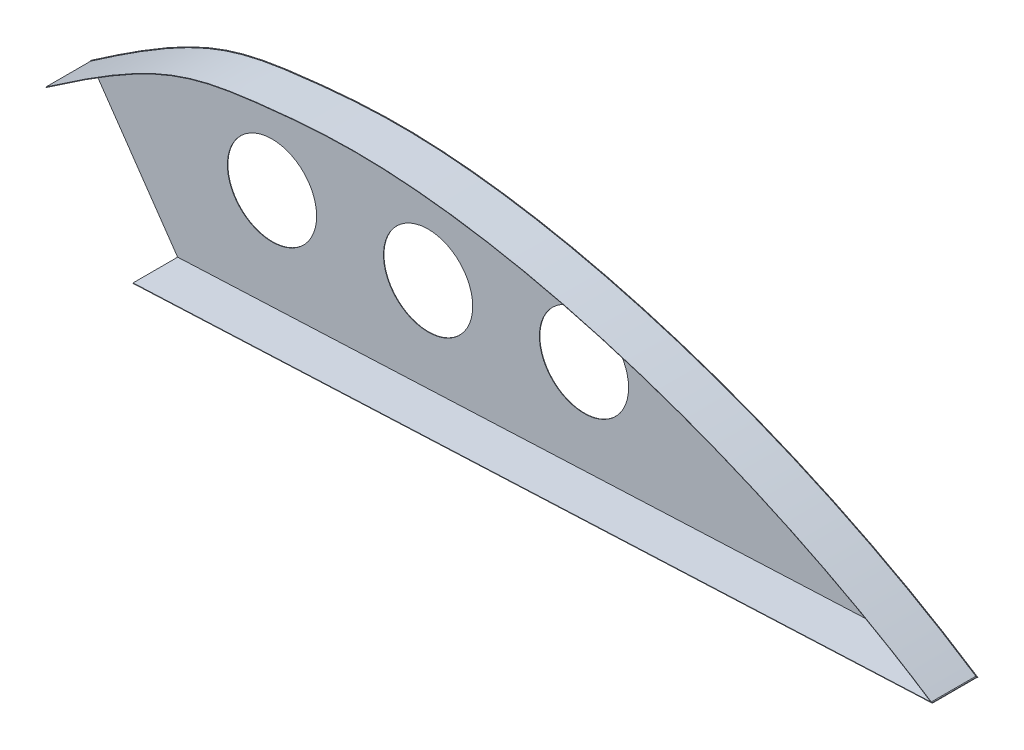
ISO-10303-21;
HEADER;
FILE_DESCRIPTION(('STEP AP214'),'2;1');
FILE_NAME('part.step','',(''),(''),'','','');
FILE_SCHEMA(('AUTOMOTIVE_DESIGN { 1 0 10303 214 1 1 1 1 }'));
ENDSEC;
DATA;
#1=APPLICATION_CONTEXT('core data for automotive mechanical design processes');
#2=APPLICATION_PROTOCOL_DEFINITION('international standard','automotive_design',2000,#1);
#3=PRODUCT_CONTEXT('',#1,'mechanical');
#4=PRODUCT('Part','Part','',(#3));
#5=PRODUCT_RELATED_PRODUCT_CATEGORY('part','',(#4));
#6=PRODUCT_DEFINITION_FORMATION('','',#4);
#7=PRODUCT_DEFINITION_CONTEXT('part definition',#1,'design');
#8=PRODUCT_DEFINITION('design','',#6,#7);
#9=PRODUCT_DEFINITION_SHAPE('','',#8);
#10=(LENGTH_UNIT() NAMED_UNIT(*) SI_UNIT(.MILLI.,.METRE.));
#11=(NAMED_UNIT(*) PLANE_ANGLE_UNIT() SI_UNIT($,.RADIAN.));
#12=(NAMED_UNIT(*) SI_UNIT($,.STERADIAN.) SOLID_ANGLE_UNIT());
#13=UNCERTAINTY_MEASURE_WITH_UNIT(LENGTH_MEASURE(1.E-05),#10,'distance_accuracy_value','');
#14=(GEOMETRIC_REPRESENTATION_CONTEXT(3) GLOBAL_UNCERTAINTY_ASSIGNED_CONTEXT((#13)) GLOBAL_UNIT_ASSIGNED_CONTEXT((#10,
#11,#12)) REPRESENTATION_CONTEXT('',''));
#15=CARTESIAN_POINT('',(0.,0.,0.));
#16=DIRECTION('',(0.,0.,1.));
#17=DIRECTION('',(1.,0.,0.));
#18=AXIS2_PLACEMENT_3D('',#15,#16,#17);
#19=CARTESIAN_POINT('',(-1659.53553734202,615.24308702669,0.099999999999989));
#20=DIRECTION('',(0.,0.,1.));
#21=DIRECTION('',(1.,0.,0.));
#22=AXIS2_PLACEMENT_3D('',#19,#20,#21);
#23=PLANE('',#22);
#24=CARTESIAN_POINT('',(-1702.86573801061,588.986400452499,0.099999999999989));
#25=DIRECTION('',(0.,0.,1.));
#26=DIRECTION('',(1.,0.,0.));
#27=AXIS2_PLACEMENT_3D('',#24,#25,#26);
#28=CIRCLE('',#27,10.0000000000001);
#29=CARTESIAN_POINT('',(-1692.86573801061,588.986400452499,0.099999999999989));
#30=VERTEX_POINT('',#29);
#31=EDGE_CURVE('E310',#30,#30,#28,.T.);
#32=ORIENTED_EDGE('',*,*,#31,.F.);
#33=EDGE_LOOP('',(#32));
#34=FACE_BOUND('',#33,.T.);
#35=CARTESIAN_POINT('',(-1667.86573801061,588.986400452499,0.099999999999989));
#36=DIRECTION('',(0.,0.,1.));
#37=DIRECTION('',(1.,0.,0.));
#38=AXIS2_PLACEMENT_3D('',#35,#36,#37);
#39=CIRCLE('',#38,9.99999999999985);
#40=CARTESIAN_POINT('',(-1657.86573801061,588.986400452499,0.099999999999989));
#41=VERTEX_POINT('',#40);
#42=EDGE_CURVE('E251',#41,#41,#39,.T.);
#43=ORIENTED_EDGE('',*,*,#42,.F.);
#44=EDGE_LOOP('',(#43));
#45=FACE_BOUND('',#44,.T.);
#46=CARTESIAN_POINT('',(-1632.90629090363,590.67075729533,0.099999999999989));
#47=DIRECTION('',(0.,0.,1.));
#48=DIRECTION('',(1.,0.,0.));
#49=AXIS2_PLACEMENT_3D('',#46,#47,#48);
#50=CIRCLE('',#49,10.0000000000001);
#51=CARTESIAN_POINT('',(-1622.90629090363,590.67075729533,0.099999999999989));
#52=VERTEX_POINT('',#51);
#53=EDGE_CURVE('E304',#52,#52,#50,.T.);
#54=ORIENTED_EDGE('',*,*,#53,.F.);
#55=EDGE_LOOP('',(#54));
#56=FACE_BOUND('',#55,.T.);
#57=DIRECTION('',(0.567607096396232,-0.823299571310856,0.));
#58=VECTOR('',#57,1.);
#59=CARTESIAN_POINT('',(-1743.60796018332,593.83047017767,0.099999999999989));
#60=LINE('',#59,#58);
#61=CARTESIAN_POINT('',(-1743.60796018332,593.83047017767,0.099999999999989));
#62=VERTEX_POINT('',#61);
#63=CARTESIAN_POINT('',(-1743.55109327918,593.748213839778,0.099999999999989));
#64=VERTEX_POINT('',#63);
#65=EDGE_CURVE('E228',#62,#64,#60,.T.);
#66=ORIENTED_EDGE('',*,*,#65,.T.);
#67=CARTESIAN_POINT('',(-1545.02307971094,573.566578824358,0.0999999999999977));
#68=CARTESIAN_POINT('',(-1580.38557088212,596.721777485731,0.0999999999999977));
#69=CARTESIAN_POINT('',(-1623.54009886865,611.778467090319,0.0999999999999977));
#70=CARTESIAN_POINT('',(-1664.05894449368,615.565415197453,0.0999999999999977));
#71=CARTESIAN_POINT('',(-1668.46062374473,615.803565887457,0.0999999999999977));
#72=CARTESIAN_POINT('',(-1674.85027289541,615.874635066804,0.0999999999999977));
#73=CARTESIAN_POINT('',(-1676.94608228937,615.848904452693,0.0999999999999977));
#74=CARTESIAN_POINT('',(-1681.05156214421,615.710135669524,0.0999999999999977));
#75=CARTESIAN_POINT('',(-1685.06731264814,615.488156685975,0.0999999999999977));
#76=CARTESIAN_POINT('',(-1688.83699666007,615.157146300184,0.0999999999999977));
#77=CARTESIAN_POINT('',(-1692.45037214897,614.800321889409,0.0999999999999977));
#78=CARTESIAN_POINT('',(-1694.17704598943,614.610346383111,0.0999999999999977));
#79=CARTESIAN_POINT('',(-1699.08573934283,614.035305054447,0.0999999999999977));
#80=CARTESIAN_POINT('',(-1702.01910126724,613.629485697198,0.0999999999999977));
#81=CARTESIAN_POINT('',(-1710.37850281503,612.027658052934,0.0999999999999977));
#82=CARTESIAN_POINT('',(-1715.3642242429,610.448022257473,0.0999999999999977));
#83=CARTESIAN_POINT('',(-1727.25276065684,604.565604120329,0.0999999999999977));
#84=CARTESIAN_POINT('',(-1734.15508646799,600.261986908841,0.0999999999999977));
#85=CARTESIAN_POINT('',(-1743.55098689514,593.748287184085,0.0999999999999977));
#86=B_SPLINE_CURVE_WITH_KNOTS('',3,(#67,#68,#69,#70,#71,#72,#73,#74,#75,#76,#77,#78,#79,#80,#81,
#82,#83,#84,#85),.UNSPECIFIED.,.F.,.F.,(4,2,2,2,1,2,2,2,2,4),(0.00149626207820732,
0.500000000000015,0.562500000000018,0.593750000000017,0.625000000000017,0.656250000000016,
0.687500000000016,0.750000000000011,0.875000000000006,1.),.UNSPECIFIED.);
#87=CARTESIAN_POINT('',(-1545.02307971094,573.566578824358,0.099999999999989));
#88=VERTEX_POINT('',#87);
#89=EDGE_CURVE('E145',#88,#64,#86,.T.);
#90=ORIENTED_EDGE('',*,*,#89,.F.);
#91=DIRECTION('',(0.995602692003064,0.093676462765476,0.));
#92=VECTOR('',#91,1.);
#93=CARTESIAN_POINT('',(-1545.02307971094,573.566578824358,0.099999999999989));
#94=LINE('',#93,#92);
#95=CARTESIAN_POINT('',(-1545.18274259771,573.55155611039,0.099999999999989));
#96=VERTEX_POINT('',#95);
#97=EDGE_CURVE('E140',#96,#88,#94,.T.);
#98=ORIENTED_EDGE('',*,*,#97,.F.);
#99=CARTESIAN_POINT('',(-1743.49401360697,593.6661041905,0.099999999999989));
#100=CARTESIAN_POINT('',(-1742.91824458099,594.065255562428,0.099999999999989));
#101=CARTESIAN_POINT('',(-1741.7499700871,594.871411778841,0.099999999999989));
#102=CARTESIAN_POINT('',(-1739.52608503395,596.390203290394,0.099999999999989));
#103=CARTESIAN_POINT('',(-1736.86780536305,598.174714984537,0.099999999999989));
#104=CARTESIAN_POINT('',(-1733.88088062316,600.125360581459,0.099999999999989));
#105=CARTESIAN_POINT('',(-1730.13578168037,602.491531609274,0.099999999999989));
#106=CARTESIAN_POINT('',(-1725.85926230919,605.03094097859,0.099999999999989));
#107=CARTESIAN_POINT('',(-1721.23073897953,607.488971472824,0.099999999999989));
#108=CARTESIAN_POINT('',(-1716.96258970869,609.437107419652,0.099999999999989));
#109=CARTESIAN_POINT('',(-1711.5599855395,611.460964287125,0.099999999999989));
#110=CARTESIAN_POINT('',(-1704.98089947415,613.117091179344,0.099999999999989));
#111=CARTESIAN_POINT('',(-1697.68082062825,614.126469300056,0.099999999999989));
#112=CARTESIAN_POINT('',(-1690.80335479766,614.881158472116,0.099999999999989));
#113=CARTESIAN_POINT('',(-1683.28277337283,615.549802626295,0.099999999999989));
#114=CARTESIAN_POINT('',(-1672.98979224291,615.951202382141,0.099999999999989));
#115=CARTESIAN_POINT('',(-1659.83071516768,615.239913168315,0.099999999999989));
#116=CARTESIAN_POINT('',(-1645.98401951829,613.44325149694,0.099999999999989));
#117=CARTESIAN_POINT('',(-1626.86027597124,609.633108879116,0.099999999999989));
#118=CARTESIAN_POINT('',(-1607.08890876538,603.79419794505,0.099999999999989));
#119=CARTESIAN_POINT('',(-1587.37621875437,596.094131565247,0.099999999999989));
#120=CARTESIAN_POINT('',(-1572.79576399975,589.430500324126,0.099999999999989));
#121=CARTESIAN_POINT('',(-1560.96559801217,583.174479228239,0.099999999999989));
#122=CARTESIAN_POINT('',(-1551.77383994301,577.764017719471,0.099999999999989));
#123=CARTESIAN_POINT('',(-1547.29656460549,574.935715783306,0.099999999999989));
#124=CARTESIAN_POINT('',(-1545.07786026992,573.482918258034,0.099999999999989));
#125=B_SPLINE_CURVE_WITH_KNOTS('',3,(#99,#100,#101,#102,#103,#104,#105,#106,#107,#108,#109,#110,
#111,#112,#113,#114,#115,#116,#117,#118,#119,#120,#121,#122,#123,#124),.UNSPECIFIED.,.F.,.F.,(4,
1,1,1,1,1,1,1,1,1,1,1,1,1,1,1,1,1,1,1,1,1,1,4),(0.00149626207820783,0.00929707253072185,
0.0170978829832359,0.0326995038882639,0.0483011247932919,0.0639027456983199,0.0951059875083758,
0.126309229318432,0.157512471128488,0.188715712938544,0.251122196558656,0.313528680178768,
0.344731921988824,0.37593516379888,0.438341647418992,0.500748131039104,0.563154614659216,
0.625561098279328,0.750374065519552,0.812780549139664,0.875187032759776,0.937593516379888,
0.968796758189944,1.),.UNSPECIFIED.);
#126=CARTESIAN_POINT('',(-1743.49401360697,593.6661041905,0.099999999999989));
#127=VERTEX_POINT('',#126);
#128=EDGE_CURVE('E187',#127,#96,#125,.T.);
#129=ORIENTED_EDGE('',*,*,#128,.F.);
#130=DIRECTION('',(0.569732881743784,-0.821829935850431,0.));
#131=VECTOR('',#130,1.);
#132=CARTESIAN_POINT('',(-1743.55098689514,593.748287184085,0.099999999999989));
#133=LINE('',#132,#131);
#134=EDGE_CURVE('E229',#64,#127,#133,.T.);
#135=ORIENTED_EDGE('',*,*,#134,.F.);
#136=CARTESIAN_POINT('',(-1723.97557604015,565.354199265099,0.099999999999989));
#137=VERTEX_POINT('',#136);
#138=EDGE_CURVE('E234',#64,#137,#60,.T.);
#139=ORIENTED_EDGE('',*,*,#138,.T.);
#140=DIRECTION('',(-0.47111626041238,0.882071124782494,0.));
#141=VECTOR('',#140,1.);
#142=CARTESIAN_POINT('',(-1106.4007933582,-590.931263522244,0.099999999999989));
#143=LINE('',#142,#141);
#144=CARTESIAN_POINT('',(-1724.02778305262,565.451946471216,0.099999999999989));
#145=VERTEX_POINT('',#144);
#146=EDGE_CURVE('E296',#137,#145,#143,.T.);
#147=ORIENTED_EDGE('',*,*,#146,.T.);
#148=DIRECTION('',(-0.998984631984301,-0.045052248103632,0.));
#149=VECTOR('',#148,1.);
#150=CARTESIAN_POINT('',(-28.9482829167909,641.896708232776,0.099999999999989));
#151=LINE('',#150,#149);
#152=CARTESIAN_POINT('',(-1544.80283170476,573.53464035455,0.099999999999989));
#153=VERTEX_POINT('',#152);
#154=EDGE_CURVE('E62',#153,#145,#151,.T.);
#155=ORIENTED_EDGE('',*,*,#154,.F.);
#156=DIRECTION('',(0.0450522481076401,-0.99898463198412,0.));
#157=VECTOR('',#156,1.);
#158=CARTESIAN_POINT('',(-1515.85454878512,-68.3620678841911,0.099999999999989));
#159=LINE('',#158,#157);
#160=CARTESIAN_POINT('',(-1544.79832647999,573.434741892322,0.099999999999989));
#161=VERTEX_POINT('',#160);
#162=EDGE_CURVE('E148',#153,#161,#159,.T.);
#163=ORIENTED_EDGE('',*,*,#162,.T.);
#164=DIRECTION('',(0.998984631984055,0.0450522481090856,0.));
#165=VECTOR('',#164,1.);
#166=CARTESIAN_POINT('',(-1723.97557604015,565.354199265099,0.099999999999989));
#167=LINE('',#166,#165);
#168=CARTESIAN_POINT('',(-1544.64995665935,573.441433080312,0.099999999999989));
#169=VERTEX_POINT('',#168);
#170=EDGE_CURVE('E233',#161,#169,#167,.T.);
#171=ORIENTED_EDGE('',*,*,#170,.T.);
#172=CARTESIAN_POINT('',(-1544.64995665935,573.441433080312,0.099999999999989));
#173=CARTESIAN_POINT('',(-1585.71664888804,600.423930322912,0.099999999999989));
#174=CARTESIAN_POINT('',(-1646.28028973819,619.241808081414,0.099999999999989));
#175=CARTESIAN_POINT('',(-1709.38954114273,613.399774738818,0.099999999999989));
#176=CARTESIAN_POINT('',(-1719.50790421298,610.537812827554,0.099999999999989));
#177=CARTESIAN_POINT('',(-1743.60796018332,593.83047017767,0.099999999999989));
#178=B_SPLINE_CURVE_WITH_KNOTS('',3,(#172,#173,#174,#175,#176,#177),.UNSPECIFIED.,.F.,.F.,(4,1,
1,4),(0.,0.579445357910707,0.679445357910707,1.),.UNSPECIFIED.);
#179=EDGE_CURVE('E237',#169,#62,#178,.T.);
#180=ORIENTED_EDGE('',*,*,#179,.T.);
#181=EDGE_LOOP('',(#66,#90,#98,#129,#135,#139,#147,#155,#163,#171,#180));
#182=FACE_BOUND('',#181,.T.);
#183=ADVANCED_FACE('F34',(#34,#45,#56,#182),#23,.T.);
#184=CARTESIAN_POINT('',(-1659.53553734202,615.24308702669,0.));
#185=DIRECTION('',(0.,0.,1.));
#186=DIRECTION('',(1.,0.,0.));
#187=AXIS2_PLACEMENT_3D('',#184,#185,#186);
#188=PLANE('',#187);
#189=CARTESIAN_POINT('',(-1544.64995665935,573.441433080312,0.));
#190=CARTESIAN_POINT('',(-1585.71664888804,600.423930322912,0.));
#191=CARTESIAN_POINT('',(-1646.28028973819,619.241808081414,0.));
#192=CARTESIAN_POINT('',(-1709.38954114273,613.399774738818,0.));
#193=CARTESIAN_POINT('',(-1719.50790421298,610.537812827554,0.));
#194=CARTESIAN_POINT('',(-1743.60796018332,593.83047017767,0.));
#195=B_SPLINE_CURVE_WITH_KNOTS('',3,(#189,#190,#191,#192,#193,#194),.UNSPECIFIED.,.F.,.F.,(4,1,
1,4),(0.,0.579445357910707,0.679445357910707,1.),.UNSPECIFIED.);
#196=CARTESIAN_POINT('',(-1544.64995665935,573.441433080312,0.));
#197=VERTEX_POINT('',#196);
#198=CARTESIAN_POINT('',(-1743.60796018332,593.83047017767,0.));
#199=VERTEX_POINT('',#198);
#200=EDGE_CURVE('E245',#197,#199,#195,.T.);
#201=ORIENTED_EDGE('',*,*,#200,.F.);
#202=DIRECTION('',(0.998984631984055,0.0450522481090856,0.));
#203=VECTOR('',#202,1.);
#204=CARTESIAN_POINT('',(-1723.97557604015,565.354199265099,0.));
#205=LINE('',#204,#203);
#206=CARTESIAN_POINT('',(-1723.97557604015,565.354199265099,0.));
#207=VERTEX_POINT('',#206);
#208=EDGE_CURVE('E256',#207,#197,#205,.T.);
#209=ORIENTED_EDGE('',*,*,#208,.F.);
#210=DIRECTION('',(0.567607096396232,-0.823299571310856,0.));
#211=VECTOR('',#210,1.);
#212=CARTESIAN_POINT('',(-1743.60796018332,593.83047017767,0.));
#213=LINE('',#212,#211);
#214=EDGE_CURVE('E250',#199,#207,#213,.T.);
#215=ORIENTED_EDGE('',*,*,#214,.F.);
#216=EDGE_LOOP('',(#201,#209,#215));
#217=FACE_BOUND('',#216,.T.);
#218=CARTESIAN_POINT('',(-1667.86573801061,588.986400452499,0.));
#219=DIRECTION('',(0.,0.,1.));
#220=DIRECTION('',(1.,0.,0.));
#221=AXIS2_PLACEMENT_3D('',#218,#219,#220);
#222=CIRCLE('',#221,9.99999999999985);
#223=CARTESIAN_POINT('',(-1657.86573801061,588.986400452499,0.));
#224=VERTEX_POINT('',#223);
#225=EDGE_CURVE('E313',#224,#224,#222,.T.);
#226=ORIENTED_EDGE('',*,*,#225,.T.);
#227=EDGE_LOOP('',(#226));
#228=FACE_BOUND('',#227,.T.);
#229=CARTESIAN_POINT('',(-1702.86573801061,588.986400452499,0.));
#230=DIRECTION('',(0.,0.,1.));
#231=DIRECTION('',(1.,0.,0.));
#232=AXIS2_PLACEMENT_3D('',#229,#230,#231);
#233=CIRCLE('',#232,10.0000000000001);
#234=CARTESIAN_POINT('',(-1692.86573801061,588.986400452499,0.));
#235=VERTEX_POINT('',#234);
#236=EDGE_CURVE('E307',#235,#235,#233,.T.);
#237=ORIENTED_EDGE('',*,*,#236,.T.);
#238=EDGE_LOOP('',(#237));
#239=FACE_BOUND('',#238,.T.);
#240=CARTESIAN_POINT('',(-1632.90629090363,590.67075729533,0.));
#241=DIRECTION('',(0.,0.,1.));
#242=DIRECTION('',(1.,0.,0.));
#243=AXIS2_PLACEMENT_3D('',#240,#241,#242);
#244=CIRCLE('',#243,10.0000000000001);
#245=CARTESIAN_POINT('',(-1622.90629090363,590.67075729533,0.));
#246=VERTEX_POINT('',#245);
#247=EDGE_CURVE('E303',#246,#246,#244,.T.);
#248=ORIENTED_EDGE('',*,*,#247,.T.);
#249=EDGE_LOOP('',(#248));
#250=FACE_BOUND('',#249,.T.);
#251=ADVANCED_FACE('F274',(#217,#228,#239,#250),#188,.F.);
#252=DIRECTION('',(0.,0.,-1.));
#253=VECTOR('',#252,1.);
#254=SURFACE_OF_LINEAR_EXTRUSION('',#178,#253);
#255=ORIENTED_EDGE('',*,*,#200,.T.);
#256=DIRECTION('',(0.,0.,-1.));
#257=VECTOR('',#256,1.);
#258=CARTESIAN_POINT('',(-1743.60796018332,593.83047017767,0.099999999999989));
#259=LINE('',#258,#257);
#260=EDGE_CURVE('E11',#62,#199,#259,.T.);
#261=ORIENTED_EDGE('',*,*,#260,.F.);
#262=ORIENTED_EDGE('',*,*,#179,.F.);
#263=DIRECTION('',(0.,0.,-1.));
#264=VECTOR('',#263,1.);
#265=CARTESIAN_POINT('',(-1544.64995665935,573.441433080312,0.099999999999989));
#266=LINE('',#265,#264);
#267=EDGE_CURVE('E244',#169,#197,#266,.T.);
#268=ORIENTED_EDGE('',*,*,#267,.T.);
#269=EDGE_LOOP('',(#255,#261,#262,#268));
#270=FACE_BOUND('',#269,.T.);
#271=ADVANCED_FACE('F36',(#270),#254,.F.);
#272=CARTESIAN_POINT('',(-1743.60796018332,593.83047017767,0.099999999999989));
#273=DIRECTION('',(0.823299571310856,0.567607096396232,0.));
#274=DIRECTION('',(-0.567607096396232,0.823299571310856,0.));
#275=AXIS2_PLACEMENT_3D('',#272,#273,#274);
#276=PLANE('',#275);
#277=ORIENTED_EDGE('',*,*,#214,.T.);
#278=DIRECTION('',(0.,0.,-1.));
#279=VECTOR('',#278,1.);
#280=CARTESIAN_POINT('',(-1723.97557604015,565.354199265099,0.099999999999989));
#281=LINE('',#280,#279);
#282=EDGE_CURVE('E46',#137,#207,#281,.T.);
#283=ORIENTED_EDGE('',*,*,#282,.F.);
#284=ORIENTED_EDGE('',*,*,#138,.F.);
#285=ORIENTED_EDGE('',*,*,#65,.F.);
#286=ORIENTED_EDGE('',*,*,#260,.T.);
#287=EDGE_LOOP('',(#277,#283,#284,#285,#286));
#288=FACE_BOUND('',#287,.T.);
#289=ADVANCED_FACE('F333',(#288),#276,.F.);
#290=CARTESIAN_POINT('',(-1723.97557604015,565.354199265099,0.099999999999989));
#291=DIRECTION('',(-0.0450522481090856,0.998984631984055,0.));
#292=DIRECTION('',(-0.998984631984055,-0.0450522481090857,0.));
#293=AXIS2_PLACEMENT_3D('',#290,#291,#292);
#294=PLANE('',#293);
#295=ORIENTED_EDGE('',*,*,#208,.T.);
#296=ORIENTED_EDGE('',*,*,#267,.F.);
#297=ORIENTED_EDGE('',*,*,#170,.F.);
#298=DIRECTION('',(0.,0.,-1.));
#299=VECTOR('',#298,1.);
#300=CARTESIAN_POINT('',(-1544.79832647999,573.434741892322,10.1));
#301=LINE('',#300,#299);
#302=CARTESIAN_POINT('',(-1544.79832647999,573.434741892322,10.1));
#303=VERTEX_POINT('',#302);
#304=EDGE_CURVE('E282',#303,#161,#301,.T.);
#305=ORIENTED_EDGE('',*,*,#304,.F.);
#306=DIRECTION('',(0.998984631984055,0.0450522481090856,0.));
#307=VECTOR('',#306,1.);
#308=CARTESIAN_POINT('',(-28.9437776959012,641.796809778665,10.1));
#309=LINE('',#308,#307);
#310=CARTESIAN_POINT('',(-1723.97557604015,565.354199265099,10.1));
#311=VERTEX_POINT('',#310);
#312=EDGE_CURVE('E289',#311,#303,#309,.T.);
#313=ORIENTED_EDGE('',*,*,#312,.F.);
#314=DIRECTION('',(0.,0.,-1.));
#315=VECTOR('',#314,1.);
#316=CARTESIAN_POINT('',(-1723.97557604015,565.354199265099,10.1));
#317=LINE('',#316,#315);
#318=EDGE_CURVE('E268',#311,#137,#317,.T.);
#319=ORIENTED_EDGE('',*,*,#318,.T.);
#320=ORIENTED_EDGE('',*,*,#282,.T.);
#321=EDGE_LOOP('',(#295,#296,#297,#305,#313,#319,#320));
#322=FACE_BOUND('',#321,.T.);
#323=ADVANCED_FACE('F265',(#322),#294,.F.);
#324=CARTESIAN_POINT('',(-1667.86573801061,588.986400452499,0.099999999999989));
#325=DIRECTION('',(0.,0.,-1.));
#326=DIRECTION('',(-1.,0.,0.));
#327=AXIS2_PLACEMENT_3D('',#324,#325,#326);
#328=CYLINDRICAL_SURFACE('',#327,9.99999999999985);
#329=ORIENTED_EDGE('',*,*,#42,.T.);
#330=EDGE_LOOP('',(#329));
#331=FACE_BOUND('',#330,.T.);
#332=ORIENTED_EDGE('',*,*,#225,.F.);
#333=EDGE_LOOP('',(#332));
#334=FACE_BOUND('',#333,.T.);
#335=ADVANCED_FACE('F321',(#331,#334),#328,.F.);
#336=CARTESIAN_POINT('',(-1702.86573801061,588.986400452499,0.099999999999989));
#337=DIRECTION('',(0.,0.,-1.));
#338=DIRECTION('',(-1.,0.,0.));
#339=AXIS2_PLACEMENT_3D('',#336,#337,#338);
#340=CYLINDRICAL_SURFACE('',#339,10.0000000000001);
#341=ORIENTED_EDGE('',*,*,#31,.T.);
#342=EDGE_LOOP('',(#341));
#343=FACE_BOUND('',#342,.T.);
#344=ORIENTED_EDGE('',*,*,#236,.F.);
#345=EDGE_LOOP('',(#344));
#346=FACE_BOUND('',#345,.T.);
#347=ADVANCED_FACE('F323',(#343,#346),#340,.F.);
#348=CARTESIAN_POINT('',(-1632.90629090363,590.67075729533,0.099999999999989));
#349=DIRECTION('',(0.,0.,-1.));
#350=DIRECTION('',(-1.,0.,0.));
#351=AXIS2_PLACEMENT_3D('',#348,#349,#350);
#352=CYLINDRICAL_SURFACE('',#351,10.0000000000001);
#353=ORIENTED_EDGE('',*,*,#53,.T.);
#354=EDGE_LOOP('',(#353));
#355=FACE_BOUND('',#354,.T.);
#356=ORIENTED_EDGE('',*,*,#247,.F.);
#357=EDGE_LOOP('',(#356));
#358=FACE_BOUND('',#357,.T.);
#359=ADVANCED_FACE('F330',(#355,#358),#352,.F.);
#360=CARTESIAN_POINT('',(-1515.85454878512,-68.3620678841911,10.1));
#361=DIRECTION('',(0.99898463198412,0.0450522481076401,0.));
#362=DIRECTION('',(-0.0450522481076401,0.99898463198412,0.));
#363=AXIS2_PLACEMENT_3D('',#360,#361,#362);
#364=PLANE('',#363);
#365=ORIENTED_EDGE('',*,*,#162,.F.);
#366=DIRECTION('',(0.,0.,-1.));
#367=VECTOR('',#366,1.);
#368=CARTESIAN_POINT('',(-1544.80283170476,573.53464035455,10.1));
#369=LINE('',#368,#367);
#370=CARTESIAN_POINT('',(-1544.80283170476,573.53464035455,10.1));
#371=VERTEX_POINT('',#370);
#372=EDGE_CURVE('E301',#371,#153,#369,.T.);
#373=ORIENTED_EDGE('',*,*,#372,.F.);
#374=DIRECTION('',(0.0450522481076401,-0.99898463198412,0.));
#375=VECTOR('',#374,1.);
#376=CARTESIAN_POINT('',(-1515.85454878512,-68.3620678841911,10.1));
#377=LINE('',#376,#375);
#378=EDGE_CURVE('E288',#371,#303,#377,.T.);
#379=ORIENTED_EDGE('',*,*,#378,.T.);
#380=ORIENTED_EDGE('',*,*,#304,.T.);
#381=EDGE_LOOP('',(#365,#373,#379,#380));
#382=FACE_BOUND('',#381,.T.);
#383=ADVANCED_FACE('F286',(#382),#364,.T.);
#384=CARTESIAN_POINT('',(-28.9482829167909,641.896708232776,10.1));
#385=DIRECTION('',(0.045052248103632,-0.998984631984301,0.));
#386=DIRECTION('',(0.998984631984301,0.045052248103632,0.));
#387=AXIS2_PLACEMENT_3D('',#384,#385,#386);
#388=PLANE('',#387);
#389=ORIENTED_EDGE('',*,*,#154,.T.);
#390=DIRECTION('',(0.,0.,-1.));
#391=VECTOR('',#390,1.);
#392=CARTESIAN_POINT('',(-1724.02778305262,565.451946471216,10.1));
#393=LINE('',#392,#391);
#394=CARTESIAN_POINT('',(-1724.02778305262,565.451946471216,10.1));
#395=VERTEX_POINT('',#394);
#396=EDGE_CURVE('E291',#395,#145,#393,.T.);
#397=ORIENTED_EDGE('',*,*,#396,.F.);
#398=DIRECTION('',(-0.998984631984301,-0.045052248103632,0.));
#399=VECTOR('',#398,1.);
#400=CARTESIAN_POINT('',(-28.9482829167909,641.896708232776,10.1));
#401=LINE('',#400,#399);
#402=EDGE_CURVE('E354',#371,#395,#401,.T.);
#403=ORIENTED_EDGE('',*,*,#402,.F.);
#404=ORIENTED_EDGE('',*,*,#372,.T.);
#405=EDGE_LOOP('',(#389,#397,#403,#404));
#406=FACE_BOUND('',#405,.T.);
#407=ADVANCED_FACE('F359',(#406),#388,.F.);
#408=CARTESIAN_POINT('',(-1106.4007933582,-590.931263522244,10.1));
#409=DIRECTION('',(-0.882071124782494,-0.47111626041238,0.));
#410=DIRECTION('',(0.47111626041238,-0.882071124782494,0.));
#411=AXIS2_PLACEMENT_3D('',#408,#409,#410);
#412=PLANE('',#411);
#413=ORIENTED_EDGE('',*,*,#146,.F.);
#414=ORIENTED_EDGE('',*,*,#318,.F.);
#415=DIRECTION('',(-0.47111626041238,0.882071124782494,0.));
#416=VECTOR('',#415,1.);
#417=CARTESIAN_POINT('',(-1106.4007933582,-590.931263522244,10.1));
#418=LINE('',#417,#416);
#419=EDGE_CURVE('E293',#311,#395,#418,.T.);
#420=ORIENTED_EDGE('',*,*,#419,.T.);
#421=ORIENTED_EDGE('',*,*,#396,.T.);
#422=EDGE_LOOP('',(#413,#414,#420,#421));
#423=FACE_BOUND('',#422,.T.);
#424=ADVANCED_FACE('F364',(#423),#412,.T.);
#425=CARTESIAN_POINT('',(0.,0.,10.1));
#426=DIRECTION('',(0.,0.,1.));
#427=DIRECTION('',(1.,0.,0.));
#428=AXIS2_PLACEMENT_3D('',#425,#426,#427);
#429=PLANE('',#428);
#430=ORIENTED_EDGE('',*,*,#378,.F.);
#431=ORIENTED_EDGE('',*,*,#402,.T.);
#432=ORIENTED_EDGE('',*,*,#419,.F.);
#433=ORIENTED_EDGE('',*,*,#312,.T.);
#434=EDGE_LOOP('',(#430,#431,#432,#433));
#435=FACE_BOUND('',#434,.T.);
#436=ADVANCED_FACE('F171',(#435),#429,.T.);
#437=CARTESIAN_POINT('',(-1544.70486849794,573.357858622593,10.1));
#438=CARTESIAN_POINT('',(-1580.12644929968,596.631286659827,10.1));
#439=CARTESIAN_POINT('',(-1623.43203040481,611.768366860211,10.1));
#440=CARTESIAN_POINT('',(-1664.05894449368,615.565415197453,10.1));
#441=CARTESIAN_POINT('',(-1668.46062374473,615.803565887457,10.1));
#442=CARTESIAN_POINT('',(-1674.85027289541,615.874635066804,10.1));
#443=CARTESIAN_POINT('',(-1676.94608228937,615.848904452693,10.1));
#444=CARTESIAN_POINT('',(-1681.05156214421,615.710135669524,10.1));
#445=CARTESIAN_POINT('',(-1685.06731264814,615.488156685975,10.1));
#446=CARTESIAN_POINT('',(-1688.83699666007,615.157146300184,10.1));
#447=CARTESIAN_POINT('',(-1692.45037214897,614.800321889409,10.1));
#448=CARTESIAN_POINT('',(-1694.17704598943,614.610346383111,10.1));
#449=CARTESIAN_POINT('',(-1699.08573934283,614.035305054447,10.1));
#450=CARTESIAN_POINT('',(-1702.01910126724,613.629485697198,10.1));
#451=CARTESIAN_POINT('',(-1710.37850281503,612.027658052934,10.1));
#452=CARTESIAN_POINT('',(-1715.3642242429,610.448022257473,10.1));
#453=CARTESIAN_POINT('',(-1727.25276065684,604.565604120329,10.1));
#454=CARTESIAN_POINT('',(-1734.15508646799,600.261986908841,10.1));
#455=CARTESIAN_POINT('',(-1743.55098689514,593.748287184085,10.1));
#456=B_SPLINE_CURVE_WITH_KNOTS('',3,(#437,#438,#439,#440,#441,#442,#443,#444,#445,#446,#447,
#448,#449,#450,#451,#452,#453,#454,#455),.UNSPECIFIED.,.F.,.F.,(4,2,2,2,1,2,2,2,2,4),(0.,
0.500000000000015,0.562500000000018,0.593750000000017,0.625000000000017,0.656250000000016,
0.687500000000016,0.750000000000011,0.875000000000006,1.),.UNSPECIFIED.);
#457=DIRECTION('',(0.,0.,-1.));
#458=VECTOR('',#457,1.);
#459=SURFACE_OF_LINEAR_EXTRUSION('',#456,#458);
#460=ORIENTED_EDGE('',*,*,#89,.T.);
#461=DIRECTION('',(0.,0.,-1.));
#462=VECTOR('',#461,1.);
#463=CARTESIAN_POINT('',(-1743.55098689514,593.748287184085,10.1));
#464=LINE('',#463,#462);
#465=CARTESIAN_POINT('',(-1743.55098689514,593.748287184085,10.1));
#466=VERTEX_POINT('',#465);
#467=EDGE_CURVE('E123',#466,#64,#464,.T.);
#468=ORIENTED_EDGE('',*,*,#467,.F.);
#469=CARTESIAN_POINT('',(-1743.55098689514,593.748287184085,10.1));
#470=CARTESIAN_POINT('',(-1734.15508646799,600.261986908841,10.1));
#471=CARTESIAN_POINT('',(-1727.25276065684,604.565604120329,10.1));
#472=CARTESIAN_POINT('',(-1715.3642242429,610.448022257473,10.1));
#473=CARTESIAN_POINT('',(-1710.37850281503,612.027658052934,10.1));
#474=CARTESIAN_POINT('',(-1702.01910126724,613.629485697198,10.1));
#475=CARTESIAN_POINT('',(-1699.08573934283,614.035305054447,10.1));
#476=CARTESIAN_POINT('',(-1694.17704598943,614.610346383111,10.1));
#477=CARTESIAN_POINT('',(-1692.45037214897,614.800321889409,10.1));
#478=CARTESIAN_POINT('',(-1688.83699666007,615.157146300184,10.1));
#479=CARTESIAN_POINT('',(-1685.06731264814,615.488156685975,10.1));
#480=CARTESIAN_POINT('',(-1681.05156214421,615.710135669524,10.1));
#481=CARTESIAN_POINT('',(-1676.94608228937,615.848904452693,10.1));
#482=CARTESIAN_POINT('',(-1674.85027289541,615.874635066804,10.1));
#483=CARTESIAN_POINT('',(-1668.46062374473,615.803565887457,10.1));
#484=CARTESIAN_POINT('',(-1664.05894449368,615.565415197453,10.1));
#485=CARTESIAN_POINT('',(-1623.54009886865,611.778467090319,10.1));
#486=CARTESIAN_POINT('',(-1580.38557088212,596.721777485731,10.1));
#487=CARTESIAN_POINT('',(-1545.02307971094,573.566578824358,10.1));
#488=B_SPLINE_CURVE_WITH_KNOTS('',3,(#469,#470,#471,#472,#473,#474,#475,#476,#477,#478,#479,
#480,#481,#482,#483,#484,#485,#486,#487),.UNSPECIFIED.,.F.,.F.,(4,2,2,2,2,1,2,2,2,4),
(0.0014962620782073,0.126496262078202,0.251496262078196,0.313996262078191,0.345246262078191,
0.37649626207819,0.40774626207819,0.43899626207819,0.501496262078192,1.),.UNSPECIFIED.);
#489=CARTESIAN_POINT('',(-1545.02307971094,573.566578824358,10.1));
#490=VERTEX_POINT('',#489);
#491=EDGE_CURVE('E130',#490,#466,#488,.F.);
#492=ORIENTED_EDGE('',*,*,#491,.F.);
#493=DIRECTION('',(0.,0.,-1.));
#494=VECTOR('',#493,1.);
#495=CARTESIAN_POINT('',(-1545.02307971094,573.566578824358,10.1));
#496=LINE('',#495,#494);
#497=EDGE_CURVE('E219',#490,#88,#496,.T.);
#498=ORIENTED_EDGE('',*,*,#497,.T.);
#499=EDGE_LOOP('',(#460,#468,#492,#498));
#500=FACE_BOUND('',#499,.T.);
#501=ADVANCED_FACE('F143',(#500),#459,.F.);
#502=CARTESIAN_POINT('',(-1743.55098689514,593.748287184085,10.1));
#503=DIRECTION('',(0.821829935850431,0.569732881743784,0.));
#504=DIRECTION('',(-0.569732881743784,0.821829935850431,0.));
#505=AXIS2_PLACEMENT_3D('',#502,#503,#504);
#506=PLANE('',#505);
#507=ORIENTED_EDGE('',*,*,#134,.T.);
#508=DIRECTION('',(0.,0.,-1.));
#509=VECTOR('',#508,1.);
#510=CARTESIAN_POINT('',(-1743.49401360697,593.6661041905,10.1));
#511=LINE('',#510,#509);
#512=CARTESIAN_POINT('',(-1743.49401360697,593.6661041905,10.1));
#513=VERTEX_POINT('',#512);
#514=EDGE_CURVE('E126',#513,#127,#511,.T.);
#515=ORIENTED_EDGE('',*,*,#514,.F.);
#516=DIRECTION('',(0.569732881743784,-0.821829935850431,0.));
#517=VECTOR('',#516,1.);
#518=CARTESIAN_POINT('',(-1743.55098689514,593.748287184085,10.1));
#519=LINE('',#518,#517);
#520=EDGE_CURVE('E119',#466,#513,#519,.T.);
#521=ORIENTED_EDGE('',*,*,#520,.F.);
#522=ORIENTED_EDGE('',*,*,#467,.T.);
#523=EDGE_LOOP('',(#507,#515,#521,#522));
#524=FACE_BOUND('',#523,.T.);
#525=ADVANCED_FACE('F121',(#524),#506,.F.);
#526=CARTESIAN_POINT('',(-1743.49401360697,593.6661041905,10.1));
#527=CARTESIAN_POINT('',(-1742.91824458099,594.065255562428,10.1));
#528=CARTESIAN_POINT('',(-1741.7499700871,594.871411778841,10.1));
#529=CARTESIAN_POINT('',(-1739.52608503395,596.390203290394,10.1));
#530=CARTESIAN_POINT('',(-1736.86780536305,598.174714984537,10.1));
#531=CARTESIAN_POINT('',(-1733.88088062316,600.125360581459,10.1));
#532=CARTESIAN_POINT('',(-1730.13578168037,602.491531609274,10.1));
#533=CARTESIAN_POINT('',(-1725.85926230919,605.03094097859,10.1));
#534=CARTESIAN_POINT('',(-1721.23073897953,607.488971472824,10.1));
#535=CARTESIAN_POINT('',(-1716.96258970869,609.437107419652,10.1));
#536=CARTESIAN_POINT('',(-1711.5599855395,611.460964287125,10.1));
#537=CARTESIAN_POINT('',(-1704.98089947415,613.117091179344,10.1));
#538=CARTESIAN_POINT('',(-1697.68082062825,614.126469300056,10.1));
#539=CARTESIAN_POINT('',(-1690.80335479766,614.881158472116,10.1));
#540=CARTESIAN_POINT('',(-1683.28277337283,615.549802626295,10.1));
#541=CARTESIAN_POINT('',(-1672.98979224291,615.951202382141,10.1));
#542=CARTESIAN_POINT('',(-1659.83071516768,615.239913168315,10.1));
#543=CARTESIAN_POINT('',(-1645.98401951829,613.44325149694,10.1));
#544=CARTESIAN_POINT('',(-1626.86027597124,609.633108879116,10.1));
#545=CARTESIAN_POINT('',(-1607.08890876538,603.79419794505,10.1));
#546=CARTESIAN_POINT('',(-1587.37621875437,596.094131565247,10.1));
#547=CARTESIAN_POINT('',(-1572.79576399975,589.430500324126,10.1));
#548=CARTESIAN_POINT('',(-1560.96559801217,583.174479228239,10.1));
#549=CARTESIAN_POINT('',(-1551.77383994301,577.764017719471,10.1));
#550=CARTESIAN_POINT('',(-1547.29656460549,574.935715783306,10.1));
#551=CARTESIAN_POINT('',(-1545.07786026992,573.482918258034,10.1));
#552=B_SPLINE_CURVE_WITH_KNOTS('',3,(#526,#527,#528,#529,#530,#531,#532,#533,#534,#535,#536,
#537,#538,#539,#540,#541,#542,#543,#544,#545,#546,#547,#548,#549,#550,#551),.UNSPECIFIED.,.F.,
.F.,(4,1,1,1,1,1,1,1,1,1,1,1,1,1,1,1,1,1,1,1,1,1,1,4),(0.00149626207820783,0.00929707253072185,
0.0170978829832359,0.0326995038882639,0.0483011247932919,0.0639027456983199,0.0951059875083758,
0.126309229318432,0.157512471128488,0.188715712938544,0.251122196558656,0.313528680178768,
0.344731921988824,0.37593516379888,0.438341647418992,0.500748131039104,0.563154614659216,
0.625561098279328,0.750374065519552,0.812780549139664,0.875187032759776,0.937593516379888,
0.968796758189944,1.),.UNSPECIFIED.);
#553=DIRECTION('',(0.,0.,-1.));
#554=VECTOR('',#553,1.);
#555=SURFACE_OF_LINEAR_EXTRUSION('',#552,#554);
#556=ORIENTED_EDGE('',*,*,#128,.T.);
#557=DIRECTION('',(0.,0.,-1.));
#558=VECTOR('',#557,1.);
#559=CARTESIAN_POINT('',(-1545.18274261047,573.551556246016,10.1));
#560=LINE('',#559,#558);
#561=CARTESIAN_POINT('',(-1545.18274261047,573.551556246016,10.1));
#562=VERTEX_POINT('',#561);
#563=EDGE_CURVE('E54',#562,#96,#560,.T.);
#564=ORIENTED_EDGE('',*,*,#563,.F.);
#565=EDGE_CURVE('E129',#513,#562,#552,.T.);
#566=ORIENTED_EDGE('',*,*,#565,.F.);
#567=ORIENTED_EDGE('',*,*,#514,.T.);
#568=EDGE_LOOP('',(#556,#564,#566,#567));
#569=FACE_BOUND('',#568,.T.);
#570=ADVANCED_FACE('F194',(#569),#555,.F.);
#571=CARTESIAN_POINT('',(-1545.02307971094,573.566578824358,10.1));
#572=DIRECTION('',(-0.093676462765476,0.995602692003064,0.));
#573=DIRECTION('',(-0.995602692003064,-0.093676462765476,0.));
#574=AXIS2_PLACEMENT_3D('',#571,#572,#573);
#575=PLANE('',#574);
#576=ORIENTED_EDGE('',*,*,#97,.T.);
#577=ORIENTED_EDGE('',*,*,#497,.F.);
#578=DIRECTION('',(0.995602692003064,0.093676462765476,0.));
#579=VECTOR('',#578,1.);
#580=CARTESIAN_POINT('',(-1545.02307971094,573.566578824358,10.1));
#581=LINE('',#580,#579);
#582=EDGE_CURVE('E135',#562,#490,#581,.T.);
#583=ORIENTED_EDGE('',*,*,#582,.F.);
#584=ORIENTED_EDGE('',*,*,#563,.T.);
#585=EDGE_LOOP('',(#576,#577,#583,#584));
#586=FACE_BOUND('',#585,.T.);
#587=ADVANCED_FACE('F197',(#586),#575,.F.);
#588=CARTESIAN_POINT('',(-1659.54484292825,615.143520937759,10.1));
#589=DIRECTION('',(0.,0.,-1.));
#590=DIRECTION('',(-1.,0.,0.));
#591=AXIS2_PLACEMENT_3D('',#588,#589,#590);
#592=PLANE('',#591);
#593=ORIENTED_EDGE('',*,*,#491,.T.);
#594=ORIENTED_EDGE('',*,*,#520,.T.);
#595=ORIENTED_EDGE('',*,*,#565,.T.);
#596=ORIENTED_EDGE('',*,*,#582,.T.);
#597=EDGE_LOOP('',(#593,#594,#595,#596));
#598=FACE_BOUND('',#597,.T.);
#599=ADVANCED_FACE('F134',(#598),#592,.F.);
#600=CLOSED_SHELL('',(#183,#251,#271,#289,#323,#335,#347,#359,#383,#407,#424,#436,#501,#525,
#570,#587,#599));
#601=MANIFOLD_SOLID_BREP('B2',#600);
#602=ADVANCED_BREP_SHAPE_REPRESENTATION('',(#18,#601),#14);
#603=SHAPE_DEFINITION_REPRESENTATION(#9,#602);
ENDSEC;
END-ISO-10303-21;
